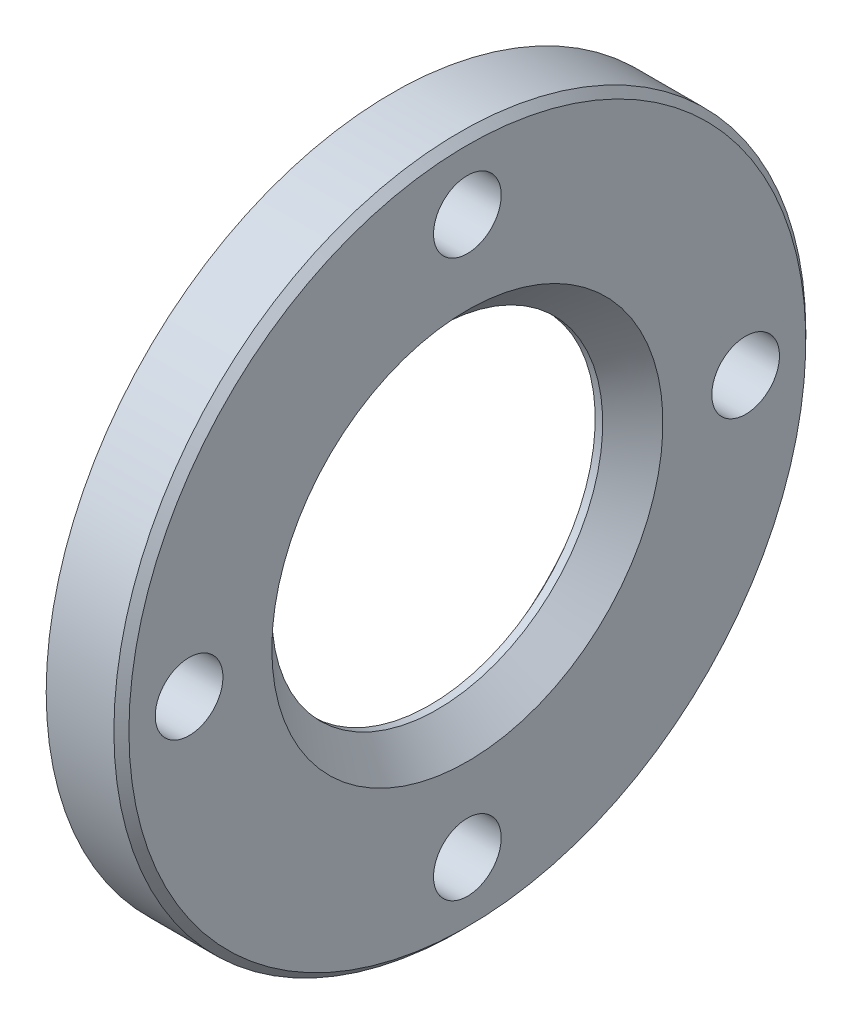
ISO-10303-21;
HEADER;
FILE_DESCRIPTION(('STEP AP214'),'2;1');
FILE_NAME('part.step','',(''),(''),'','','');
FILE_SCHEMA(('AUTOMOTIVE_DESIGN { 1 0 10303 214 1 1 1 1 }'));
ENDSEC;
DATA;
#1=APPLICATION_CONTEXT('core data for automotive mechanical design processes');
#2=APPLICATION_PROTOCOL_DEFINITION('international standard','automotive_design',2000,#1);
#3=PRODUCT_CONTEXT('',#1,'mechanical');
#4=PRODUCT('Part','Part','',(#3));
#5=PRODUCT_RELATED_PRODUCT_CATEGORY('part','',(#4));
#6=PRODUCT_DEFINITION_FORMATION('','',#4);
#7=PRODUCT_DEFINITION_CONTEXT('part definition',#1,'design');
#8=PRODUCT_DEFINITION('design','',#6,#7);
#9=PRODUCT_DEFINITION_SHAPE('','',#8);
#10=(LENGTH_UNIT() NAMED_UNIT(*) SI_UNIT(.MILLI.,.METRE.));
#11=(NAMED_UNIT(*) PLANE_ANGLE_UNIT() SI_UNIT($,.RADIAN.));
#12=(NAMED_UNIT(*) SI_UNIT($,.STERADIAN.) SOLID_ANGLE_UNIT());
#13=UNCERTAINTY_MEASURE_WITH_UNIT(LENGTH_MEASURE(1.E-05),#10,'distance_accuracy_value','');
#14=(GEOMETRIC_REPRESENTATION_CONTEXT(3) GLOBAL_UNCERTAINTY_ASSIGNED_CONTEXT((#13)) GLOBAL_UNIT_ASSIGNED_CONTEXT((#10,
#11,#12)) REPRESENTATION_CONTEXT('',''));
#15=CARTESIAN_POINT('',(0.,0.,0.));
#16=DIRECTION('',(0.,0.,1.));
#17=DIRECTION('',(1.,0.,0.));
#18=AXIS2_PLACEMENT_3D('',#15,#16,#17);
#19=CARTESIAN_POINT('',(0.,0.,0.));
#20=DIRECTION('',(-1.,0.,0.));
#21=DIRECTION('',(0.,0.,1.));
#22=AXIS2_PLACEMENT_3D('',#19,#20,#21);
#23=CYLINDRICAL_SURFACE('',#22,14.5);
#24=CARTESIAN_POINT('',(2.5,0.,0.));
#25=DIRECTION('',(-1.,0.,0.));
#26=DIRECTION('',(0.,0.,1.));
#27=AXIS2_PLACEMENT_3D('',#24,#25,#26);
#28=CIRCLE('',#27,14.5);
#29=CARTESIAN_POINT('',(2.5,0.,14.5));
#30=VERTEX_POINT('',#29);
#31=EDGE_CURVE('E63',#30,#30,#28,.T.);
#32=ORIENTED_EDGE('',*,*,#31,.F.);
#33=EDGE_LOOP('',(#32));
#34=FACE_BOUND('',#33,.T.);
#35=CARTESIAN_POINT('',(0.,0.,0.));
#36=DIRECTION('',(-1.,0.,0.));
#37=DIRECTION('',(0.,0.,1.));
#38=AXIS2_PLACEMENT_3D('',#35,#36,#37);
#39=CIRCLE('',#38,14.5);
#40=CARTESIAN_POINT('',(0.,0.,14.5));
#41=VERTEX_POINT('',#40);
#42=EDGE_CURVE('E45',#41,#41,#39,.T.);
#43=ORIENTED_EDGE('',*,*,#42,.T.);
#44=EDGE_LOOP('',(#43));
#45=FACE_BOUND('',#44,.T.);
#46=ADVANCED_FACE('F34',(#34,#45),#23,.F.);
#47=CARTESIAN_POINT('',(0.,23.,0.));
#48=DIRECTION('',(1.,0.,0.));
#49=DIRECTION('',(0.,0.,-1.));
#50=AXIS2_PLACEMENT_3D('',#47,#48,#49);
#51=PLANE('',#50);
#52=CARTESIAN_POINT('',(0.,1.93777214305794E-13,18.5));
#53=DIRECTION('',(1.,0.,0.));
#54=DIRECTION('',(0.,1.,0.));
#55=AXIS2_PLACEMENT_3D('',#52,#53,#54);
#56=CIRCLE('',#55,2.25);
#57=CARTESIAN_POINT('',(0.,2.25000000000019,18.5));
#58=VERTEX_POINT('',#57);
#59=EDGE_CURVE('E82',#58,#58,#56,.T.);
#60=ORIENTED_EDGE('',*,*,#59,.T.);
#61=EDGE_LOOP('',(#60));
#62=FACE_BOUND('',#61,.T.);
#63=CARTESIAN_POINT('',(0.,-18.5,0.));
#64=DIRECTION('',(1.,0.,0.));
#65=DIRECTION('',(0.,0.,1.));
#66=AXIS2_PLACEMENT_3D('',#63,#64,#65);
#67=CIRCLE('',#66,2.25);
#68=CARTESIAN_POINT('',(0.,-18.5,2.25));
#69=VERTEX_POINT('',#68);
#70=EDGE_CURVE('E76',#69,#69,#67,.T.);
#71=ORIENTED_EDGE('',*,*,#70,.T.);
#72=EDGE_LOOP('',(#71));
#73=FACE_BOUND('',#72,.T.);
#74=CARTESIAN_POINT('',(0.,0.,-18.5));
#75=DIRECTION('',(1.,0.,0.));
#76=DIRECTION('',(0.,-1.,0.));
#77=AXIS2_PLACEMENT_3D('',#74,#75,#76);
#78=CIRCLE('',#77,2.25);
#79=CARTESIAN_POINT('',(0.,-2.25000000000006,-18.5));
#80=VERTEX_POINT('',#79);
#81=EDGE_CURVE('E70',#80,#80,#78,.T.);
#82=ORIENTED_EDGE('',*,*,#81,.T.);
#83=EDGE_LOOP('',(#82));
#84=FACE_BOUND('',#83,.T.);
#85=CARTESIAN_POINT('',(0.,18.5,0.));
#86=DIRECTION('',(1.,0.,0.));
#87=DIRECTION('',(0.,0.,-1.));
#88=AXIS2_PLACEMENT_3D('',#85,#86,#87);
#89=CIRCLE('',#88,2.25);
#90=CARTESIAN_POINT('',(0.,18.5,-2.25));
#91=VERTEX_POINT('',#90);
#92=EDGE_CURVE('E66',#91,#91,#89,.T.);
#93=ORIENTED_EDGE('',*,*,#92,.T.);
#94=EDGE_LOOP('',(#93));
#95=FACE_BOUND('',#94,.T.);
#96=ORIENTED_EDGE('',*,*,#42,.F.);
#97=EDGE_LOOP('',(#96));
#98=FACE_BOUND('',#97,.T.);
#99=CARTESIAN_POINT('',(0.,0.,0.));
#100=DIRECTION('',(-1.,0.,0.));
#101=DIRECTION('',(0.,0.,1.));
#102=AXIS2_PLACEMENT_3D('',#99,#100,#101);
#103=CIRCLE('',#102,23.);
#104=CARTESIAN_POINT('',(0.,0.,23.));
#105=VERTEX_POINT('',#104);
#106=EDGE_CURVE('E49',#105,#105,#103,.T.);
#107=ORIENTED_EDGE('',*,*,#106,.T.);
#108=EDGE_LOOP('',(#107));
#109=FACE_BOUND('',#108,.T.);
#110=ADVANCED_FACE('F91',(#62,#73,#84,#95,#98,#109),#51,.F.);
#111=CARTESIAN_POINT('',(0.,0.,0.));
#112=DIRECTION('',(-1.,0.,0.));
#113=DIRECTION('',(0.,0.,1.));
#114=AXIS2_PLACEMENT_3D('',#111,#112,#113);
#115=CYLINDRICAL_SURFACE('',#114,23.);
#116=CARTESIAN_POINT('',(4.49999999999999,0.,0.));
#117=DIRECTION('',(-1.,0.,0.));
#118=DIRECTION('',(0.,0.,1.));
#119=AXIS2_PLACEMENT_3D('',#116,#117,#118);
#120=CIRCLE('',#119,23.);
#121=CARTESIAN_POINT('',(4.49999999999999,0.,23.));
#122=VERTEX_POINT('',#121);
#123=EDGE_CURVE('E41',#122,#122,#120,.T.);
#124=ORIENTED_EDGE('',*,*,#123,.T.);
#125=EDGE_LOOP('',(#124));
#126=FACE_BOUND('',#125,.T.);
#127=ORIENTED_EDGE('',*,*,#106,.F.);
#128=EDGE_LOOP('',(#127));
#129=FACE_BOUND('',#128,.T.);
#130=ADVANCED_FACE('F105',(#126,#129),#115,.T.);
#131=CARTESIAN_POINT('',(5.,13.,0.));
#132=DIRECTION('',(-1.,0.,0.));
#133=DIRECTION('',(0.,0.,1.));
#134=AXIS2_PLACEMENT_3D('',#131,#132,#133);
#135=PLANE('',#134);
#136=CARTESIAN_POINT('',(5.,0.,0.));
#137=DIRECTION('',(-1.,0.,0.));
#138=DIRECTION('',(0.,0.,1.));
#139=AXIS2_PLACEMENT_3D('',#136,#137,#138);
#140=CIRCLE('',#139,22.5);
#141=CARTESIAN_POINT('',(5.,0.,22.5));
#142=VERTEX_POINT('',#141);
#143=EDGE_CURVE('E10',#142,#142,#140,.F.);
#144=ORIENTED_EDGE('',*,*,#143,.T.);
#145=EDGE_LOOP('',(#144));
#146=FACE_BOUND('',#145,.T.);
#147=CARTESIAN_POINT('',(5.,1.93777214305794E-13,18.5));
#148=DIRECTION('',(1.,0.,0.));
#149=DIRECTION('',(0.,1.,0.));
#150=AXIS2_PLACEMENT_3D('',#147,#148,#149);
#151=CIRCLE('',#150,2.25);
#152=CARTESIAN_POINT('',(5.,2.25000000000019,18.5));
#153=VERTEX_POINT('',#152);
#154=EDGE_CURVE('E85',#153,#153,#151,.T.);
#155=ORIENTED_EDGE('',*,*,#154,.F.);
#156=EDGE_LOOP('',(#155));
#157=FACE_BOUND('',#156,.T.);
#158=CARTESIAN_POINT('',(5.,-18.5,0.));
#159=DIRECTION('',(1.,0.,0.));
#160=DIRECTION('',(0.,0.,1.));
#161=AXIS2_PLACEMENT_3D('',#158,#159,#160);
#162=CIRCLE('',#161,2.25);
#163=CARTESIAN_POINT('',(5.,-18.5,2.25));
#164=VERTEX_POINT('',#163);
#165=EDGE_CURVE('E79',#164,#164,#162,.T.);
#166=ORIENTED_EDGE('',*,*,#165,.F.);
#167=EDGE_LOOP('',(#166));
#168=FACE_BOUND('',#167,.T.);
#169=CARTESIAN_POINT('',(5.,0.,-18.5));
#170=DIRECTION('',(1.,0.,0.));
#171=DIRECTION('',(0.,-1.,0.));
#172=AXIS2_PLACEMENT_3D('',#169,#170,#171);
#173=CIRCLE('',#172,2.25);
#174=CARTESIAN_POINT('',(5.,-2.25000000000006,-18.5));
#175=VERTEX_POINT('',#174);
#176=EDGE_CURVE('E73',#175,#175,#173,.T.);
#177=ORIENTED_EDGE('',*,*,#176,.F.);
#178=EDGE_LOOP('',(#177));
#179=FACE_BOUND('',#178,.T.);
#180=CARTESIAN_POINT('',(5.,18.5,0.));
#181=DIRECTION('',(1.,0.,0.));
#182=DIRECTION('',(0.,0.,-1.));
#183=AXIS2_PLACEMENT_3D('',#180,#181,#182);
#184=CIRCLE('',#183,2.25);
#185=CARTESIAN_POINT('',(5.,18.5,-2.25));
#186=VERTEX_POINT('',#185);
#187=EDGE_CURVE('E67',#186,#186,#184,.T.);
#188=ORIENTED_EDGE('',*,*,#187,.F.);
#189=EDGE_LOOP('',(#188));
#190=FACE_BOUND('',#189,.T.);
#191=CARTESIAN_POINT('',(5.,0.,0.));
#192=DIRECTION('',(-1.,0.,0.));
#193=DIRECTION('',(0.,0.,1.));
#194=AXIS2_PLACEMENT_3D('',#191,#192,#193);
#195=CIRCLE('',#194,13.);
#196=CARTESIAN_POINT('',(5.,0.,13.));
#197=VERTEX_POINT('',#196);
#198=EDGE_CURVE('E54',#197,#197,#195,.T.);
#199=ORIENTED_EDGE('',*,*,#198,.T.);
#200=EDGE_LOOP('',(#199));
#201=FACE_BOUND('',#200,.T.);
#202=ADVANCED_FACE('F101',(#146,#157,#168,#179,#190,#201),#135,.F.);
#203=CARTESIAN_POINT('',(3.,0.,0.));
#204=DIRECTION('',(1.,0.,0.));
#205=DIRECTION('',(0.,0.,-1.));
#206=AXIS2_PLACEMENT_3D('',#203,#204,#205);
#207=CONICAL_SURFACE('',#206,11.,0.78539816339745);
#208=ORIENTED_EDGE('',*,*,#198,.F.);
#209=EDGE_LOOP('',(#208));
#210=FACE_BOUND('',#209,.T.);
#211=CARTESIAN_POINT('',(3.,0.,0.));
#212=DIRECTION('',(-1.,0.,0.));
#213=DIRECTION('',(0.,0.,1.));
#214=AXIS2_PLACEMENT_3D('',#211,#212,#213);
#215=CIRCLE('',#214,11.);
#216=CARTESIAN_POINT('',(3.,0.,11.));
#217=VERTEX_POINT('',#216);
#218=EDGE_CURVE('E57',#217,#217,#215,.T.);
#219=ORIENTED_EDGE('',*,*,#218,.T.);
#220=EDGE_LOOP('',(#219));
#221=FACE_BOUND('',#220,.T.);
#222=ADVANCED_FACE('F104',(#210,#221),#207,.F.);
#223=CARTESIAN_POINT('',(0.,0.,0.));
#224=DIRECTION('',(-1.,0.,0.));
#225=DIRECTION('',(0.,0.,1.));
#226=AXIS2_PLACEMENT_3D('',#223,#224,#225);
#227=CYLINDRICAL_SURFACE('',#226,11.);
#228=ORIENTED_EDGE('',*,*,#218,.F.);
#229=EDGE_LOOP('',(#228));
#230=FACE_BOUND('',#229,.T.);
#231=CARTESIAN_POINT('',(2.5,0.,0.));
#232=DIRECTION('',(-1.,0.,0.));
#233=DIRECTION('',(0.,0.,1.));
#234=AXIS2_PLACEMENT_3D('',#231,#232,#233);
#235=CIRCLE('',#234,11.);
#236=CARTESIAN_POINT('',(2.5,0.,11.));
#237=VERTEX_POINT('',#236);
#238=EDGE_CURVE('E60',#237,#237,#235,.T.);
#239=ORIENTED_EDGE('',*,*,#238,.T.);
#240=EDGE_LOOP('',(#239));
#241=FACE_BOUND('',#240,.T.);
#242=ADVANCED_FACE('F117',(#230,#241),#227,.F.);
#243=CARTESIAN_POINT('',(2.5,14.5,0.));
#244=DIRECTION('',(1.,0.,0.));
#245=DIRECTION('',(0.,0.,-1.));
#246=AXIS2_PLACEMENT_3D('',#243,#244,#245);
#247=PLANE('',#246);
#248=ORIENTED_EDGE('',*,*,#238,.F.);
#249=EDGE_LOOP('',(#248));
#250=FACE_BOUND('',#249,.T.);
#251=ORIENTED_EDGE('',*,*,#31,.T.);
#252=EDGE_LOOP('',(#251));
#253=FACE_BOUND('',#252,.T.);
#254=ADVANCED_FACE('F123',(#250,#253),#247,.F.);
#255=CARTESIAN_POINT('',(0.,18.5,0.));
#256=DIRECTION('',(1.,0.,0.));
#257=DIRECTION('',(0.,0.,-1.));
#258=AXIS2_PLACEMENT_3D('',#255,#256,#257);
#259=CYLINDRICAL_SURFACE('',#258,2.25);
#260=ORIENTED_EDGE('',*,*,#92,.F.);
#261=EDGE_LOOP('',(#260));
#262=FACE_BOUND('',#261,.T.);
#263=ORIENTED_EDGE('',*,*,#187,.T.);
#264=EDGE_LOOP('',(#263));
#265=FACE_BOUND('',#264,.T.);
#266=ADVANCED_FACE('F129',(#262,#265),#259,.F.);
#267=CARTESIAN_POINT('',(0.,0.,-18.5));
#268=DIRECTION('',(1.,0.,0.));
#269=DIRECTION('',(0.,0.,-1.));
#270=AXIS2_PLACEMENT_3D('',#267,#268,#269);
#271=CYLINDRICAL_SURFACE('',#270,2.25);
#272=ORIENTED_EDGE('',*,*,#81,.F.);
#273=EDGE_LOOP('',(#272));
#274=FACE_BOUND('',#273,.T.);
#275=ORIENTED_EDGE('',*,*,#176,.T.);
#276=EDGE_LOOP('',(#275));
#277=FACE_BOUND('',#276,.T.);
#278=ADVANCED_FACE('F149',(#274,#277),#271,.F.);
#279=CARTESIAN_POINT('',(0.,-18.5,0.));
#280=DIRECTION('',(1.,0.,0.));
#281=DIRECTION('',(0.,0.,-1.));
#282=AXIS2_PLACEMENT_3D('',#279,#280,#281);
#283=CYLINDRICAL_SURFACE('',#282,2.25);
#284=ORIENTED_EDGE('',*,*,#70,.F.);
#285=EDGE_LOOP('',(#284));
#286=FACE_BOUND('',#285,.T.);
#287=ORIENTED_EDGE('',*,*,#165,.T.);
#288=EDGE_LOOP('',(#287));
#289=FACE_BOUND('',#288,.T.);
#290=ADVANCED_FACE('F97',(#286,#289),#283,.F.);
#291=CARTESIAN_POINT('',(0.,1.93777214305794E-13,18.5));
#292=DIRECTION('',(1.,0.,0.));
#293=DIRECTION('',(0.,0.,-1.));
#294=AXIS2_PLACEMENT_3D('',#291,#292,#293);
#295=CYLINDRICAL_SURFACE('',#294,2.25);
#296=ORIENTED_EDGE('',*,*,#59,.F.);
#297=EDGE_LOOP('',(#296));
#298=FACE_BOUND('',#297,.T.);
#299=ORIENTED_EDGE('',*,*,#154,.T.);
#300=EDGE_LOOP('',(#299));
#301=FACE_BOUND('',#300,.T.);
#302=ADVANCED_FACE('F94',(#298,#301),#295,.F.);
#303=CARTESIAN_POINT('',(4.49999999999999,0.,0.));
#304=DIRECTION('',(-1.,0.,0.));
#305=DIRECTION('',(0.,0.,1.));
#306=AXIS2_PLACEMENT_3D('',#303,#304,#305);
#307=CONICAL_SURFACE('',#306,23.,0.785398163397452);
#308=ORIENTED_EDGE('',*,*,#143,.F.);
#309=EDGE_LOOP('',(#308));
#310=FACE_BOUND('',#309,.T.);
#311=ORIENTED_EDGE('',*,*,#123,.F.);
#312=EDGE_LOOP('',(#311));
#313=FACE_BOUND('',#312,.T.);
#314=ADVANCED_FACE('F36',(#310,#313),#307,.T.);
#315=CLOSED_SHELL('',(#46,#110,#130,#202,#222,#242,#254,#266,#278,#290,#302,#314));
#316=MANIFOLD_SOLID_BREP('B2',#315);
#317=ADVANCED_BREP_SHAPE_REPRESENTATION('',(#18,#316),#14);
#318=SHAPE_DEFINITION_REPRESENTATION(#9,#317);
ENDSEC;
END-ISO-10303-21;
